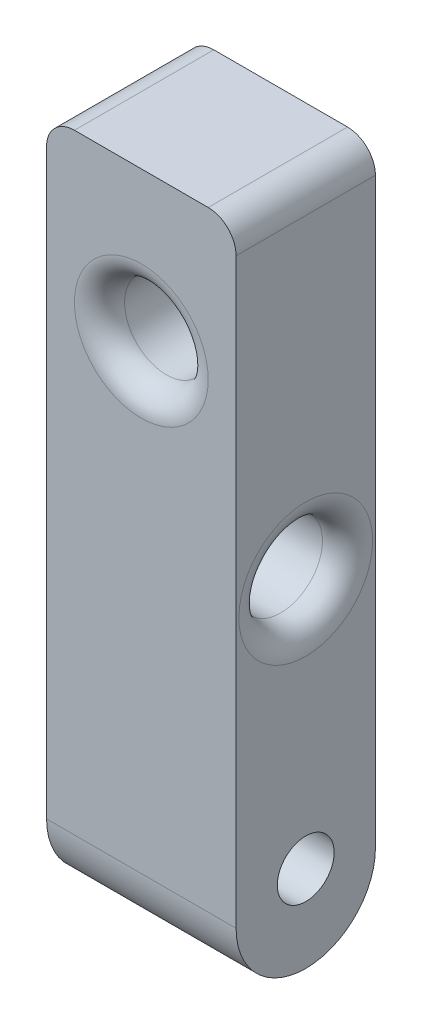
ISO-10303-21;
HEADER;
FILE_DESCRIPTION(('STEP AP214'),'2;1');
FILE_NAME('part.step','',(''),(''),'','','');
FILE_SCHEMA(('AUTOMOTIVE_DESIGN { 1 0 10303 214 1 1 1 1 }'));
ENDSEC;
DATA;
#1=APPLICATION_CONTEXT('core data for automotive mechanical design processes');
#2=APPLICATION_PROTOCOL_DEFINITION('international standard','automotive_design',2000,#1);
#3=PRODUCT_CONTEXT('',#1,'mechanical');
#4=PRODUCT('Part','Part','',(#3));
#5=PRODUCT_RELATED_PRODUCT_CATEGORY('part','',(#4));
#6=PRODUCT_DEFINITION_FORMATION('','',#4);
#7=PRODUCT_DEFINITION_CONTEXT('part definition',#1,'design');
#8=PRODUCT_DEFINITION('design','',#6,#7);
#9=PRODUCT_DEFINITION_SHAPE('','',#8);
#10=(LENGTH_UNIT() NAMED_UNIT(*) SI_UNIT(.MILLI.,.METRE.));
#11=(NAMED_UNIT(*) PLANE_ANGLE_UNIT() SI_UNIT($,.RADIAN.));
#12=(NAMED_UNIT(*) SI_UNIT($,.STERADIAN.) SOLID_ANGLE_UNIT());
#13=UNCERTAINTY_MEASURE_WITH_UNIT(LENGTH_MEASURE(1.E-05),#10,'distance_accuracy_value','');
#14=(GEOMETRIC_REPRESENTATION_CONTEXT(3) GLOBAL_UNCERTAINTY_ASSIGNED_CONTEXT((#13)) GLOBAL_UNIT_ASSIGNED_CONTEXT((#10,
#11,#12)) REPRESENTATION_CONTEXT('',''));
#15=CARTESIAN_POINT('',(0.,0.,0.));
#16=DIRECTION('',(0.,0.,1.));
#17=DIRECTION('',(1.,0.,0.));
#18=AXIS2_PLACEMENT_3D('',#15,#16,#17);
#19=CARTESIAN_POINT('',(-17.,-48.5,12.5));
#20=DIRECTION('',(1.,0.,0.));
#21=DIRECTION('',(0.,0.,-1.));
#22=AXIS2_PLACEMENT_3D('',#19,#20,#21);
#23=CYLINDRICAL_SURFACE('',#22,12.5);
#24=DIRECTION('',(-1.,0.,0.));
#25=VECTOR('',#24,1.);
#26=CARTESIAN_POINT('',(-17.,-48.5,25.));
#27=LINE('',#26,#25);
#28=CARTESIAN_POINT('',(-17.,-48.4999999999999,25.));
#29=VERTEX_POINT('',#28);
#30=CARTESIAN_POINT('',(17.,-48.5,25.));
#31=VERTEX_POINT('',#30);
#32=EDGE_CURVE('E155',#29,#31,#27,.F.);
#33=ORIENTED_EDGE('',*,*,#32,.F.);
#34=CARTESIAN_POINT('',(-17.,-48.5,12.5));
#35=DIRECTION('',(1.,0.,0.));
#36=DIRECTION('',(0.,1.,0.));
#37=AXIS2_PLACEMENT_3D('',#34,#35,#36);
#38=CIRCLE('',#37,12.5);
#39=CARTESIAN_POINT('',(-17.,-48.4999999999999,0.));
#40=VERTEX_POINT('',#39);
#41=EDGE_CURVE('E43',#40,#29,#38,.F.);
#42=ORIENTED_EDGE('',*,*,#41,.F.);
#43=DIRECTION('',(1.,0.,0.));
#44=VECTOR('',#43,1.);
#45=CARTESIAN_POINT('',(0.,-48.5,0.));
#46=LINE('',#45,#44);
#47=CARTESIAN_POINT('',(17.,-48.5,0.));
#48=VERTEX_POINT('',#47);
#49=EDGE_CURVE('E158',#48,#40,#46,.F.);
#50=ORIENTED_EDGE('',*,*,#49,.F.);
#51=CARTESIAN_POINT('',(17.,-48.5,12.5));
#52=DIRECTION('',(-1.,0.,0.));
#53=DIRECTION('',(0.,-1.,0.));
#54=AXIS2_PLACEMENT_3D('',#51,#52,#53);
#55=CIRCLE('',#54,12.5);
#56=EDGE_CURVE('E11',#31,#48,#55,.F.);
#57=ORIENTED_EDGE('',*,*,#56,.F.);
#58=EDGE_LOOP('',(#33,#42,#50,#57));
#59=FACE_BOUND('',#58,.T.);
#60=ADVANCED_FACE('F35',(#59),#23,.T.);
#61=CARTESIAN_POINT('',(-17.,-45.5,12.5));
#62=DIRECTION('',(1.,0.,0.));
#63=DIRECTION('',(0.,1.,0.));
#64=AXIS2_PLACEMENT_3D('',#61,#62,#63);
#65=CYLINDRICAL_SURFACE('',#64,5.1);
#66=CARTESIAN_POINT('',(17.,-45.5,12.5));
#67=DIRECTION('',(1.,0.,0.));
#68=DIRECTION('',(0.,1.,0.));
#69=AXIS2_PLACEMENT_3D('',#66,#67,#68);
#70=CIRCLE('',#69,5.1);
#71=CARTESIAN_POINT('',(17.,-40.4,12.5));
#72=VERTEX_POINT('',#71);
#73=EDGE_CURVE('E172',#72,#72,#70,.T.);
#74=ORIENTED_EDGE('',*,*,#73,.T.);
#75=EDGE_LOOP('',(#74));
#76=FACE_BOUND('',#75,.T.);
#77=CARTESIAN_POINT('',(-13.5,-45.5,12.5));
#78=DIRECTION('',(-1.,0.,0.));
#79=DIRECTION('',(0.,-1.,0.));
#80=AXIS2_PLACEMENT_3D('',#77,#78,#79);
#81=CIRCLE('',#80,5.1);
#82=CARTESIAN_POINT('',(-13.5,-50.6,12.5));
#83=VERTEX_POINT('',#82);
#84=EDGE_CURVE('E121',#83,#83,#81,.F.);
#85=ORIENTED_EDGE('',*,*,#84,.F.);
#86=EDGE_LOOP('',(#85));
#87=FACE_BOUND('',#86,.T.);
#88=ADVANCED_FACE('F235',(#76,#87),#65,.F.);
#89=CARTESIAN_POINT('',(0.,0.,25.));
#90=DIRECTION('',(0.,0.,1.));
#91=DIRECTION('',(1.,0.,0.));
#92=AXIS2_PLACEMENT_3D('',#89,#90,#91);
#93=PLANE('',#92);
#94=CARTESIAN_POINT('',(0.,34.25,25.));
#95=DIRECTION('',(0.,0.,1.));
#96=DIRECTION('',(1.,0.,0.));
#97=AXIS2_PLACEMENT_3D('',#94,#95,#96);
#98=CIRCLE('',#97,12.);
#99=CARTESIAN_POINT('',(12.,34.25,25.));
#100=VERTEX_POINT('',#99);
#101=EDGE_CURVE('E129',#100,#100,#98,.F.);
#102=ORIENTED_EDGE('',*,*,#101,.T.);
#103=EDGE_LOOP('',(#102));
#104=FACE_BOUND('',#103,.T.);
#105=DIRECTION('',(0.,-1.,0.));
#106=VECTOR('',#105,1.);
#107=CARTESIAN_POINT('',(-17.,61.,25.));
#108=LINE('',#107,#106);
#109=CARTESIAN_POINT('',(-17.,56.,25.));
#110=VERTEX_POINT('',#109);
#111=EDGE_CURVE('E130',#110,#29,#108,.T.);
#112=ORIENTED_EDGE('',*,*,#111,.T.);
#113=ORIENTED_EDGE('',*,*,#32,.T.);
#114=DIRECTION('',(0.,1.,0.));
#115=VECTOR('',#114,1.);
#116=CARTESIAN_POINT('',(17.,61.,25.));
#117=LINE('',#116,#115);
#118=CARTESIAN_POINT('',(17.,56.,25.));
#119=VERTEX_POINT('',#118);
#120=EDGE_CURVE('E115',#31,#119,#117,.T.);
#121=ORIENTED_EDGE('',*,*,#120,.T.);
#122=CARTESIAN_POINT('',(12.,56.,25.));
#123=DIRECTION('',(0.,0.,1.));
#124=DIRECTION('',(1.,0.,0.));
#125=AXIS2_PLACEMENT_3D('',#122,#123,#124);
#126=CIRCLE('',#125,5.);
#127=CARTESIAN_POINT('',(12.,61.,25.));
#128=VERTEX_POINT('',#127);
#129=EDGE_CURVE('E150',#119,#128,#126,.T.);
#130=ORIENTED_EDGE('',*,*,#129,.T.);
#131=DIRECTION('',(-1.,0.,0.));
#132=VECTOR('',#131,1.);
#133=CARTESIAN_POINT('',(-17.,61.,25.));
#134=LINE('',#133,#132);
#135=CARTESIAN_POINT('',(-12.,61.,25.));
#136=VERTEX_POINT('',#135);
#137=EDGE_CURVE('E105',#128,#136,#134,.T.);
#138=ORIENTED_EDGE('',*,*,#137,.T.);
#139=CARTESIAN_POINT('',(-12.,56.,25.));
#140=DIRECTION('',(0.,0.,1.));
#141=DIRECTION('',(1.,0.,0.));
#142=AXIS2_PLACEMENT_3D('',#139,#140,#141);
#143=CIRCLE('',#142,5.);
#144=EDGE_CURVE('E148',#136,#110,#143,.T.);
#145=ORIENTED_EDGE('',*,*,#144,.T.);
#146=EDGE_LOOP('',(#112,#113,#121,#130,#138,#145));
#147=FACE_BOUND('',#146,.T.);
#148=ADVANCED_FACE('F165',(#104,#147),#93,.T.);
#149=CARTESIAN_POINT('',(0.,0.,0.));
#150=DIRECTION('',(0.,0.,1.));
#151=DIRECTION('',(1.,0.,0.));
#152=AXIS2_PLACEMENT_3D('',#149,#150,#151);
#153=PLANE('',#152);
#154=CARTESIAN_POINT('',(0.,-23.,0.));
#155=DIRECTION('',(0.,0.,-1.));
#156=DIRECTION('',(-1.,0.,0.));
#157=AXIS2_PLACEMENT_3D('',#154,#155,#156);
#158=CIRCLE('',#157,4.1);
#159=CARTESIAN_POINT('',(-4.1,-23.,0.));
#160=VERTEX_POINT('',#159);
#161=EDGE_CURVE('E124',#160,#160,#158,.T.);
#162=ORIENTED_EDGE('',*,*,#161,.F.);
#163=EDGE_LOOP('',(#162));
#164=FACE_BOUND('',#163,.T.);
#165=DIRECTION('',(0.,1.,0.));
#166=VECTOR('',#165,1.);
#167=CARTESIAN_POINT('',(17.,61.,0.));
#168=LINE('',#167,#166);
#169=CARTESIAN_POINT('',(17.,56.,0.));
#170=VERTEX_POINT('',#169);
#171=EDGE_CURVE('E112',#48,#170,#168,.T.);
#172=ORIENTED_EDGE('',*,*,#171,.F.);
#173=ORIENTED_EDGE('',*,*,#49,.T.);
#174=DIRECTION('',(0.,-1.,0.));
#175=VECTOR('',#174,1.);
#176=CARTESIAN_POINT('',(-17.,61.,0.));
#177=LINE('',#176,#175);
#178=CARTESIAN_POINT('',(-17.,56.,0.));
#179=VERTEX_POINT('',#178);
#180=EDGE_CURVE('E111',#179,#40,#177,.T.);
#181=ORIENTED_EDGE('',*,*,#180,.F.);
#182=CARTESIAN_POINT('',(-12.,56.,0.));
#183=DIRECTION('',(0.,0.,1.));
#184=DIRECTION('',(1.,0.,0.));
#185=AXIS2_PLACEMENT_3D('',#182,#183,#184);
#186=CIRCLE('',#185,5.);
#187=CARTESIAN_POINT('',(-12.,61.,0.));
#188=VERTEX_POINT('',#187);
#189=EDGE_CURVE('E96',#179,#188,#186,.F.);
#190=ORIENTED_EDGE('',*,*,#189,.T.);
#191=DIRECTION('',(-1.,0.,0.));
#192=VECTOR('',#191,1.);
#193=CARTESIAN_POINT('',(-17.,61.,0.));
#194=LINE('',#193,#192);
#195=CARTESIAN_POINT('',(12.,61.,0.));
#196=VERTEX_POINT('',#195);
#197=EDGE_CURVE('E102',#196,#188,#194,.T.);
#198=ORIENTED_EDGE('',*,*,#197,.F.);
#199=CARTESIAN_POINT('',(12.,56.,0.));
#200=DIRECTION('',(0.,0.,1.));
#201=DIRECTION('',(1.,0.,0.));
#202=AXIS2_PLACEMENT_3D('',#199,#200,#201);
#203=CIRCLE('',#202,5.);
#204=EDGE_CURVE('E86',#196,#170,#203,.F.);
#205=ORIENTED_EDGE('',*,*,#204,.T.);
#206=EDGE_LOOP('',(#172,#173,#181,#190,#198,#205));
#207=FACE_BOUND('',#206,.T.);
#208=CARTESIAN_POINT('',(0.,34.25,0.));
#209=DIRECTION('',(0.,0.,1.));
#210=DIRECTION('',(1.,0.,0.));
#211=AXIS2_PLACEMENT_3D('',#208,#209,#210);
#212=CIRCLE('',#211,7.5);
#213=CARTESIAN_POINT('',(7.5,34.25,0.));
#214=VERTEX_POINT('',#213);
#215=EDGE_CURVE('E117',#214,#214,#212,.T.);
#216=ORIENTED_EDGE('',*,*,#215,.T.);
#217=EDGE_LOOP('',(#216));
#218=FACE_BOUND('',#217,.T.);
#219=ADVANCED_FACE('F108',(#164,#207,#218),#153,.F.);
#220=CARTESIAN_POINT('',(17.,61.,25.));
#221=DIRECTION('',(-1.,0.,0.));
#222=DIRECTION('',(0.,-1.,0.));
#223=AXIS2_PLACEMENT_3D('',#220,#221,#222);
#224=PLANE('',#223);
#225=CARTESIAN_POINT('',(17.,-0.499999999999973,12.5));
#226=DIRECTION('',(-1.,0.,0.));
#227=DIRECTION('',(0.,-1.,0.));
#228=AXIS2_PLACEMENT_3D('',#225,#226,#227);
#229=CIRCLE('',#228,12.);
#230=CARTESIAN_POINT('',(17.,-12.5,12.5));
#231=VERTEX_POINT('',#230);
#232=EDGE_CURVE('E139',#231,#231,#229,.T.);
#233=ORIENTED_EDGE('',*,*,#232,.T.);
#234=EDGE_LOOP('',(#233));
#235=FACE_BOUND('',#234,.T.);
#236=ORIENTED_EDGE('',*,*,#73,.F.);
#237=EDGE_LOOP('',(#236));
#238=FACE_BOUND('',#237,.T.);
#239=ORIENTED_EDGE('',*,*,#120,.F.);
#240=ORIENTED_EDGE('',*,*,#56,.T.);
#241=ORIENTED_EDGE('',*,*,#171,.T.);
#242=DIRECTION('',(0.,0.,-1.));
#243=VECTOR('',#242,1.);
#244=CARTESIAN_POINT('',(17.,56.,25.));
#245=LINE('',#244,#243);
#246=EDGE_CURVE('E92',#170,#119,#245,.F.);
#247=ORIENTED_EDGE('',*,*,#246,.T.);
#248=EDGE_LOOP('',(#239,#240,#241,#247));
#249=FACE_BOUND('',#248,.T.);
#250=ADVANCED_FACE('F255',(#235,#238,#249),#224,.F.);
#251=CARTESIAN_POINT('',(-17.,61.,25.));
#252=DIRECTION('',(0.,-1.,0.));
#253=DIRECTION('',(0.,0.,-1.));
#254=AXIS2_PLACEMENT_3D('',#251,#252,#253);
#255=PLANE('',#254);
#256=ORIENTED_EDGE('',*,*,#137,.F.);
#257=DIRECTION('',(0.,0.,-1.));
#258=VECTOR('',#257,1.);
#259=CARTESIAN_POINT('',(12.,61.,25.));
#260=LINE('',#259,#258);
#261=EDGE_CURVE('E90',#128,#196,#260,.T.);
#262=ORIENTED_EDGE('',*,*,#261,.T.);
#263=ORIENTED_EDGE('',*,*,#197,.T.);
#264=DIRECTION('',(0.,0.,-1.));
#265=VECTOR('',#264,1.);
#266=CARTESIAN_POINT('',(-12.,61.,25.));
#267=LINE('',#266,#265);
#268=EDGE_CURVE('E106',#188,#136,#267,.F.);
#269=ORIENTED_EDGE('',*,*,#268,.T.);
#270=EDGE_LOOP('',(#256,#262,#263,#269));
#271=FACE_BOUND('',#270,.T.);
#272=ADVANCED_FACE('F101',(#271),#255,.F.);
#273=CARTESIAN_POINT('',(-17.,61.,25.));
#274=DIRECTION('',(1.,0.,0.));
#275=DIRECTION('',(0.,1.,0.));
#276=AXIS2_PLACEMENT_3D('',#273,#274,#275);
#277=PLANE('',#276);
#278=CARTESIAN_POINT('',(-17.,-0.499999999999977,12.5));
#279=DIRECTION('',(1.,0.,0.));
#280=DIRECTION('',(0.,1.,0.));
#281=AXIS2_PLACEMENT_3D('',#278,#279,#280);
#282=CIRCLE('',#281,12.);
#283=CARTESIAN_POINT('',(-17.,11.5,12.5));
#284=VERTEX_POINT('',#283);
#285=EDGE_CURVE('E142',#284,#284,#282,.T.);
#286=ORIENTED_EDGE('',*,*,#285,.T.);
#287=EDGE_LOOP('',(#286));
#288=FACE_BOUND('',#287,.T.);
#289=CARTESIAN_POINT('',(-17.,-45.5,12.5));
#290=DIRECTION('',(-1.,0.,0.));
#291=DIRECTION('',(0.,-1.,0.));
#292=AXIS2_PLACEMENT_3D('',#289,#290,#291);
#293=CIRCLE('',#292,11.1);
#294=CARTESIAN_POINT('',(-17.,-56.6,12.5));
#295=VERTEX_POINT('',#294);
#296=EDGE_CURVE('E180',#295,#295,#293,.T.);
#297=ORIENTED_EDGE('',*,*,#296,.F.);
#298=EDGE_LOOP('',(#297));
#299=FACE_BOUND('',#298,.T.);
#300=ORIENTED_EDGE('',*,*,#180,.T.);
#301=ORIENTED_EDGE('',*,*,#41,.T.);
#302=ORIENTED_EDGE('',*,*,#111,.F.);
#303=DIRECTION('',(0.,0.,-1.));
#304=VECTOR('',#303,1.);
#305=CARTESIAN_POINT('',(-17.,56.,25.));
#306=LINE('',#305,#304);
#307=EDGE_CURVE('E152',#110,#179,#306,.T.);
#308=ORIENTED_EDGE('',*,*,#307,.T.);
#309=EDGE_LOOP('',(#300,#301,#302,#308));
#310=FACE_BOUND('',#309,.T.);
#311=ADVANCED_FACE('F161',(#288,#299,#310),#277,.F.);
#312=CARTESIAN_POINT('',(0.,34.25,25.));
#313=DIRECTION('',(0.,0.,-1.));
#314=DIRECTION('',(-1.,0.,0.));
#315=AXIS2_PLACEMENT_3D('',#312,#313,#314);
#316=CYLINDRICAL_SURFACE('',#315,7.5);
#317=CARTESIAN_POINT('',(0.,34.25,20.5));
#318=DIRECTION('',(0.,0.,1.));
#319=DIRECTION('',(1.,0.,0.));
#320=AXIS2_PLACEMENT_3D('',#317,#318,#319);
#321=CIRCLE('',#320,7.5);
#322=CARTESIAN_POINT('',(7.5,34.25,20.5));
#323=VERTEX_POINT('',#322);
#324=EDGE_CURVE('E126',#323,#323,#321,.T.);
#325=ORIENTED_EDGE('',*,*,#324,.T.);
#326=EDGE_LOOP('',(#325));
#327=FACE_BOUND('',#326,.T.);
#328=ORIENTED_EDGE('',*,*,#215,.F.);
#329=EDGE_LOOP('',(#328));
#330=FACE_BOUND('',#329,.T.);
#331=ADVANCED_FACE('F249',(#327,#330),#316,.F.);
#332=CARTESIAN_POINT('',(-17.,-0.499999999999977,12.5));
#333=DIRECTION('',(1.,0.,0.));
#334=DIRECTION('',(0.,1.,0.));
#335=AXIS2_PLACEMENT_3D('',#332,#333,#334);
#336=CYLINDRICAL_SURFACE('',#335,7.5);
#337=CARTESIAN_POINT('',(12.5,-0.499999999999973,12.5));
#338=DIRECTION('',(-1.,0.,0.));
#339=DIRECTION('',(0.,-1.,0.));
#340=AXIS2_PLACEMENT_3D('',#337,#338,#339);
#341=CIRCLE('',#340,7.5);
#342=CARTESIAN_POINT('',(12.5,7.00000000000003,12.5));
#343=VERTEX_POINT('',#342);
#344=EDGE_CURVE('E136',#343,#343,#341,.F.);
#345=CARTESIAN_POINT('',(-12.5,-0.499999999999977,12.5));
#346=DIRECTION('',(1.,0.,0.));
#347=DIRECTION('',(0.,1.,0.));
#348=AXIS2_PLACEMENT_3D('',#345,#346,#347);
#349=CIRCLE('',#348,7.5);
#350=CARTESIAN_POINT('',(-12.5,7.00000000000002,12.5));
#351=VERTEX_POINT('',#350);
#352=EDGE_CURVE('E133',#351,#351,#349,.F.);
#353=CARTESIAN_POINT('',(12.5,7.00000000000003,12.5));
#354=CARTESIAN_POINT('',(12.2395833333333,7.00000000000003,12.5));
#355=CARTESIAN_POINT('',(11.9791666666667,7.00000000000003,12.5));
#356=CARTESIAN_POINT('',(11.4583333333333,7.00000000000003,12.5));
#357=CARTESIAN_POINT('',(11.1979166666667,7.00000000000003,12.5));
#358=CARTESIAN_POINT('',(10.6770833333333,7.00000000000003,12.5));
#359=CARTESIAN_POINT('',(10.4166666666667,7.00000000000003,12.5));
#360=CARTESIAN_POINT('',(9.89583333333333,7.00000000000003,12.5));
#361=CARTESIAN_POINT('',(9.63541666666667,7.00000000000003,12.5));
#362=CARTESIAN_POINT('',(9.11458333333334,7.00000000000003,12.5));
#363=CARTESIAN_POINT('',(8.85416666666667,7.00000000000003,12.5));
#364=CARTESIAN_POINT('',(8.33333333333334,7.00000000000003,12.5));
#365=CARTESIAN_POINT('',(8.07291666666667,7.00000000000003,12.5));
#366=CARTESIAN_POINT('',(7.55208333333334,7.00000000000003,12.5));
#367=CARTESIAN_POINT('',(7.29166666666667,7.00000000000003,12.5));
#368=CARTESIAN_POINT('',(6.77083333333334,7.00000000000003,12.5));
#369=CARTESIAN_POINT('',(6.51041666666667,7.00000000000003,12.5));
#370=CARTESIAN_POINT('',(5.98958333333334,7.00000000000003,12.5));
#371=CARTESIAN_POINT('',(5.72916666666667,7.00000000000003,12.5));
#372=CARTESIAN_POINT('',(5.20833333333333,7.00000000000003,12.5));
#373=CARTESIAN_POINT('',(4.94791666666667,7.00000000000002,12.5));
#374=CARTESIAN_POINT('',(4.42708333333333,7.00000000000002,12.5));
#375=CARTESIAN_POINT('',(4.16666666666667,7.00000000000002,12.5));
#376=CARTESIAN_POINT('',(3.64583333333333,7.00000000000002,12.5));
#377=CARTESIAN_POINT('',(3.38541666666667,7.00000000000002,12.5));
#378=CARTESIAN_POINT('',(2.86458333333333,7.00000000000002,12.5));
#379=CARTESIAN_POINT('',(2.60416666666667,7.00000000000002,12.5));
#380=CARTESIAN_POINT('',(2.08333333333333,7.00000000000002,12.5));
#381=CARTESIAN_POINT('',(1.82291666666667,7.00000000000002,12.5));
#382=CARTESIAN_POINT('',(1.30208333333333,7.00000000000002,12.5));
#383=CARTESIAN_POINT('',(1.04166666666667,7.00000000000002,12.5));
#384=CARTESIAN_POINT('',(0.520833333333334,7.00000000000002,12.5));
#385=CARTESIAN_POINT('',(0.260416666666667,7.00000000000002,12.5));
#386=CARTESIAN_POINT('',(-0.260416666666667,7.00000000000002,12.5));
#387=CARTESIAN_POINT('',(-0.520833333333334,7.00000000000002,12.5));
#388=CARTESIAN_POINT('',(-1.04166666666667,7.00000000000002,12.5));
#389=CARTESIAN_POINT('',(-1.30208333333333,7.00000000000002,12.5));
#390=CARTESIAN_POINT('',(-1.82291666666667,7.00000000000002,12.5));
#391=CARTESIAN_POINT('',(-2.08333333333333,7.00000000000002,12.5));
#392=CARTESIAN_POINT('',(-2.60416666666667,7.00000000000002,12.5));
#393=CARTESIAN_POINT('',(-2.86458333333334,7.00000000000002,12.5));
#394=CARTESIAN_POINT('',(-3.38541666666667,7.00000000000002,12.5));
#395=CARTESIAN_POINT('',(-3.64583333333333,7.00000000000002,12.5));
#396=CARTESIAN_POINT('',(-4.16666666666667,7.00000000000002,12.5));
#397=CARTESIAN_POINT('',(-4.42708333333333,7.00000000000002,12.5));
#398=CARTESIAN_POINT('',(-4.94791666666667,7.00000000000002,12.5));
#399=CARTESIAN_POINT('',(-5.20833333333333,7.00000000000002,12.5));
#400=CARTESIAN_POINT('',(-5.72916666666667,7.00000000000002,12.5));
#401=CARTESIAN_POINT('',(-5.98958333333334,7.00000000000002,12.5));
#402=CARTESIAN_POINT('',(-6.51041666666667,7.00000000000002,12.5));
#403=CARTESIAN_POINT('',(-6.77083333333334,7.00000000000002,12.5));
#404=CARTESIAN_POINT('',(-7.29166666666667,7.00000000000002,12.5));
#405=CARTESIAN_POINT('',(-7.55208333333334,7.00000000000002,12.5));
#406=CARTESIAN_POINT('',(-8.07291666666667,7.00000000000002,12.5));
#407=CARTESIAN_POINT('',(-8.33333333333334,7.00000000000002,12.5));
#408=CARTESIAN_POINT('',(-8.85416666666667,7.00000000000002,12.5));
#409=CARTESIAN_POINT('',(-9.11458333333334,7.00000000000002,12.5));
#410=CARTESIAN_POINT('',(-9.63541666666667,7.00000000000002,12.5));
#411=CARTESIAN_POINT('',(-9.89583333333333,7.00000000000002,12.5));
#412=CARTESIAN_POINT('',(-10.4166666666667,7.00000000000002,12.5));
#413=CARTESIAN_POINT('',(-10.6770833333333,7.00000000000002,12.5));
#414=CARTESIAN_POINT('',(-11.1979166666667,7.00000000000002,12.5));
#415=CARTESIAN_POINT('',(-11.4583333333333,7.00000000000002,12.5));
#416=CARTESIAN_POINT('',(-11.9791666666667,7.00000000000002,12.5));
#417=CARTESIAN_POINT('',(-12.2395833333333,7.00000000000002,12.5));
#418=CARTESIAN_POINT('',(-12.5,7.00000000000002,12.5));
#419=B_SPLINE_CURVE_WITH_KNOTS('',3,(#353,#354,#355,#356,#357,#358,#359,#360,#361,#362,#363,
#364,#365,#366,#367,#368,#369,#370,#371,#372,#373,#374,#375,#376,#377,#378,#379,#380,#381,#382,
#383,#384,#385,#386,#387,#388,#389,#390,#391,#392,#393,#394,#395,#396,#397,#398,#399,#400,#401,
#402,#403,#404,#405,#406,#407,#408,#409,#410,#411,#412,#413,#414,#415,#416,#417,#418),
.UNSPECIFIED.,.F.,.F.,(4,2,2,2,2,2,2,2,2,2,2,2,2,2,2,2,2,2,2,2,2,2,2,2,2,2,2,2,2,2,2,2,4),(0.,
0.781250000000001,1.5625,2.34375,3.125,3.90625,4.6875,5.46875,6.25,7.03125,7.8125,8.59375,9.375,
10.15625,10.9375,11.71875,12.5,13.28125,14.0625,14.84375,15.625,16.40625,17.1875,17.96875,18.75,
19.53125,20.3125,21.09375,21.875,22.65625,23.4375,24.21875,25.),.UNSPECIFIED.);
#420=EDGE_CURVE('BSEAM247',#343,#351,#419,.T.);
#421=ORIENTED_EDGE('',*,*,#344,.T.);
#422=ORIENTED_EDGE('',*,*,#352,.T.);
#423=ORIENTED_EDGE('',*,*,#420,.T.);
#424=ORIENTED_EDGE('',*,*,#420,.F.);
#425=EDGE_LOOP('',(#421,#423,#422,#424));
#426=FACE_BOUND('',#425,.T.);
#427=ADVANCED_FACE('F247',(#426),#336,.F.);
#428=CARTESIAN_POINT('',(0.,-23.,18.));
#429=DIRECTION('',(0.,0.,-1.));
#430=DIRECTION('',(-1.,0.,0.));
#431=AXIS2_PLACEMENT_3D('',#428,#429,#430);
#432=CYLINDRICAL_SURFACE('',#431,4.1);
#433=CARTESIAN_POINT('',(0.,-23.,18.));
#434=DIRECTION('',(0.,0.,-1.));
#435=DIRECTION('',(-1.,0.,0.));
#436=AXIS2_PLACEMENT_3D('',#433,#434,#435);
#437=CIRCLE('',#436,4.1);
#438=CARTESIAN_POINT('',(-4.1,-23.,18.));
#439=VERTEX_POINT('',#438);
#440=EDGE_CURVE('E175',#439,#439,#437,.T.);
#441=ORIENTED_EDGE('',*,*,#440,.F.);
#442=EDGE_LOOP('',(#441));
#443=FACE_BOUND('',#442,.T.);
#444=ORIENTED_EDGE('',*,*,#161,.T.);
#445=EDGE_LOOP('',(#444));
#446=FACE_BOUND('',#445,.T.);
#447=ADVANCED_FACE('F377',(#443,#446),#432,.F.);
#448=CARTESIAN_POINT('',(0.,-23.,18.));
#449=DIRECTION('',(0.,0.,-1.));
#450=DIRECTION('',(-1.,0.,0.));
#451=AXIS2_PLACEMENT_3D('',#448,#449,#450);
#452=PLANE('',#451);
#453=ORIENTED_EDGE('',*,*,#440,.T.);
#454=EDGE_LOOP('',(#453));
#455=FACE_BOUND('',#454,.T.);
#456=ADVANCED_FACE('F223',(#455),#452,.T.);
#457=CARTESIAN_POINT('',(-13.5,-45.5,12.5));
#458=DIRECTION('',(-1.,0.,0.));
#459=DIRECTION('',(0.,-1.,0.));
#460=AXIS2_PLACEMENT_3D('',#457,#458,#459);
#461=PLANE('',#460);
#462=CARTESIAN_POINT('',(-13.5,-37.5,12.5));
#463=DIRECTION('',(-1.,0.,0.));
#464=DIRECTION('',(0.,-1.,0.));
#465=AXIS2_PLACEMENT_3D('',#462,#463,#464);
#466=CIRCLE('',#465,1.4);
#467=CARTESIAN_POINT('',(-13.5,-38.9,12.5));
#468=VERTEX_POINT('',#467);
#469=EDGE_CURVE('E204',#468,#468,#466,.T.);
#470=ORIENTED_EDGE('',*,*,#469,.F.);
#471=EDGE_LOOP('',(#470));
#472=FACE_BOUND('',#471,.T.);
#473=CARTESIAN_POINT('',(-13.5,-45.4999999999998,20.5000000000002));
#474=DIRECTION('',(-1.,0.,0.));
#475=DIRECTION('',(0.,-1.,0.));
#476=AXIS2_PLACEMENT_3D('',#473,#474,#475);
#477=CIRCLE('',#476,1.4);
#478=CARTESIAN_POINT('',(-13.5,-46.8999999999998,20.5000000000002));
#479=VERTEX_POINT('',#478);
#480=EDGE_CURVE('E198',#479,#479,#477,.T.);
#481=ORIENTED_EDGE('',*,*,#480,.F.);
#482=EDGE_LOOP('',(#481));
#483=FACE_BOUND('',#482,.T.);
#484=CARTESIAN_POINT('',(-13.5,-53.5,12.5000000000004));
#485=DIRECTION('',(-1.,0.,0.));
#486=DIRECTION('',(0.,-1.,0.));
#487=AXIS2_PLACEMENT_3D('',#484,#485,#486);
#488=CIRCLE('',#487,1.4);
#489=CARTESIAN_POINT('',(-13.5,-54.9,12.5000000000004));
#490=VERTEX_POINT('',#489);
#491=EDGE_CURVE('E192',#490,#490,#488,.T.);
#492=ORIENTED_EDGE('',*,*,#491,.F.);
#493=EDGE_LOOP('',(#492));
#494=FACE_BOUND('',#493,.T.);
#495=CARTESIAN_POINT('',(-13.5,-45.5000000000001,4.50000000000023));
#496=DIRECTION('',(-1.,0.,0.));
#497=DIRECTION('',(0.,-1.,0.));
#498=AXIS2_PLACEMENT_3D('',#495,#496,#497);
#499=CIRCLE('',#498,1.4);
#500=CARTESIAN_POINT('',(-13.5,-46.9000000000001,4.50000000000023));
#501=VERTEX_POINT('',#500);
#502=EDGE_CURVE('E186',#501,#501,#499,.T.);
#503=ORIENTED_EDGE('',*,*,#502,.F.);
#504=EDGE_LOOP('',(#503));
#505=FACE_BOUND('',#504,.T.);
#506=CARTESIAN_POINT('',(-13.5,-45.5,12.5));
#507=DIRECTION('',(-1.,0.,0.));
#508=DIRECTION('',(0.,-1.,0.));
#509=AXIS2_PLACEMENT_3D('',#506,#507,#508);
#510=CIRCLE('',#509,11.1);
#511=CARTESIAN_POINT('',(-13.5,-56.6,12.5));
#512=VERTEX_POINT('',#511);
#513=EDGE_CURVE('E125',#512,#512,#510,.T.);
#514=ORIENTED_EDGE('',*,*,#513,.T.);
#515=EDGE_LOOP('',(#514));
#516=FACE_BOUND('',#515,.T.);
#517=ORIENTED_EDGE('',*,*,#84,.T.);
#518=EDGE_LOOP('',(#517));
#519=FACE_BOUND('',#518,.T.);
#520=ADVANCED_FACE('F219',(#472,#483,#494,#505,#516,#519),#461,.T.);
#521=CARTESIAN_POINT('',(-13.5,-45.5,12.5));
#522=DIRECTION('',(-1.,0.,0.));
#523=DIRECTION('',(0.,-1.,0.));
#524=AXIS2_PLACEMENT_3D('',#521,#522,#523);
#525=CYLINDRICAL_SURFACE('',#524,11.1);
#526=ORIENTED_EDGE('',*,*,#513,.F.);
#527=EDGE_LOOP('',(#526));
#528=FACE_BOUND('',#527,.T.);
#529=ORIENTED_EDGE('',*,*,#296,.T.);
#530=EDGE_LOOP('',(#529));
#531=FACE_BOUND('',#530,.T.);
#532=ADVANCED_FACE('F222',(#528,#531),#525,.F.);
#533=CARTESIAN_POINT('',(-3.5,-45.5000000000001,4.50000000000023));
#534=DIRECTION('',(-1.,0.,0.));
#535=DIRECTION('',(0.,-1.,0.));
#536=AXIS2_PLACEMENT_3D('',#533,#534,#535);
#537=CYLINDRICAL_SURFACE('',#536,1.4);
#538=CARTESIAN_POINT('',(-3.5,-45.5000000000001,4.50000000000023));
#539=DIRECTION('',(-1.,0.,0.));
#540=DIRECTION('',(0.,-1.,0.));
#541=AXIS2_PLACEMENT_3D('',#538,#539,#540);
#542=CIRCLE('',#541,1.4);
#543=CARTESIAN_POINT('',(-3.5,-46.9000000000001,4.50000000000023));
#544=VERTEX_POINT('',#543);
#545=EDGE_CURVE('E189',#544,#544,#542,.T.);
#546=ORIENTED_EDGE('',*,*,#545,.F.);
#547=EDGE_LOOP('',(#546));
#548=FACE_BOUND('',#547,.T.);
#549=ORIENTED_EDGE('',*,*,#502,.T.);
#550=EDGE_LOOP('',(#549));
#551=FACE_BOUND('',#550,.T.);
#552=ADVANCED_FACE('F351',(#548,#551),#537,.F.);
#553=CARTESIAN_POINT('',(-3.5,-45.5000000000001,4.50000000000023));
#554=DIRECTION('',(-1.,0.,0.));
#555=DIRECTION('',(0.,-1.,0.));
#556=AXIS2_PLACEMENT_3D('',#553,#554,#555);
#557=PLANE('',#556);
#558=ORIENTED_EDGE('',*,*,#545,.T.);
#559=EDGE_LOOP('',(#558));
#560=FACE_BOUND('',#559,.T.);
#561=ADVANCED_FACE('F343',(#560),#557,.T.);
#562=CARTESIAN_POINT('',(-3.5,-53.5,12.5000000000004));
#563=DIRECTION('',(-1.,0.,0.));
#564=DIRECTION('',(0.,-1.,0.));
#565=AXIS2_PLACEMENT_3D('',#562,#563,#564);
#566=CYLINDRICAL_SURFACE('',#565,1.4);
#567=CARTESIAN_POINT('',(-3.5,-53.5,12.5000000000004));
#568=DIRECTION('',(-1.,0.,0.));
#569=DIRECTION('',(0.,-1.,0.));
#570=AXIS2_PLACEMENT_3D('',#567,#568,#569);
#571=CIRCLE('',#570,1.4);
#572=CARTESIAN_POINT('',(-3.5,-54.9,12.5000000000004));
#573=VERTEX_POINT('',#572);
#574=EDGE_CURVE('E195',#573,#573,#571,.T.);
#575=ORIENTED_EDGE('',*,*,#574,.F.);
#576=EDGE_LOOP('',(#575));
#577=FACE_BOUND('',#576,.T.);
#578=ORIENTED_EDGE('',*,*,#491,.T.);
#579=EDGE_LOOP('',(#578));
#580=FACE_BOUND('',#579,.T.);
#581=ADVANCED_FACE('F335',(#577,#580),#566,.F.);
#582=CARTESIAN_POINT('',(-3.5,-53.5,12.5000000000004));
#583=DIRECTION('',(-1.,0.,0.));
#584=DIRECTION('',(0.,-1.,0.));
#585=AXIS2_PLACEMENT_3D('',#582,#583,#584);
#586=PLANE('',#585);
#587=ORIENTED_EDGE('',*,*,#574,.T.);
#588=EDGE_LOOP('',(#587));
#589=FACE_BOUND('',#588,.T.);
#590=ADVANCED_FACE('F327',(#589),#586,.T.);
#591=CARTESIAN_POINT('',(-3.5,-45.4999999999998,20.5000000000002));
#592=DIRECTION('',(-1.,0.,0.));
#593=DIRECTION('',(0.,-1.,0.));
#594=AXIS2_PLACEMENT_3D('',#591,#592,#593);
#595=CYLINDRICAL_SURFACE('',#594,1.4);
#596=CARTESIAN_POINT('',(-3.5,-45.4999999999998,20.5000000000002));
#597=DIRECTION('',(-1.,0.,0.));
#598=DIRECTION('',(0.,-1.,0.));
#599=AXIS2_PLACEMENT_3D('',#596,#597,#598);
#600=CIRCLE('',#599,1.4);
#601=CARTESIAN_POINT('',(-3.5,-46.8999999999998,20.5000000000002));
#602=VERTEX_POINT('',#601);
#603=EDGE_CURVE('E201',#602,#602,#600,.T.);
#604=ORIENTED_EDGE('',*,*,#603,.F.);
#605=EDGE_LOOP('',(#604));
#606=FACE_BOUND('',#605,.T.);
#607=ORIENTED_EDGE('',*,*,#480,.T.);
#608=EDGE_LOOP('',(#607));
#609=FACE_BOUND('',#608,.T.);
#610=ADVANCED_FACE('F319',(#606,#609),#595,.F.);
#611=CARTESIAN_POINT('',(-3.5,-45.4999999999998,20.5000000000002));
#612=DIRECTION('',(-1.,0.,0.));
#613=DIRECTION('',(0.,-1.,0.));
#614=AXIS2_PLACEMENT_3D('',#611,#612,#613);
#615=PLANE('',#614);
#616=ORIENTED_EDGE('',*,*,#603,.T.);
#617=EDGE_LOOP('',(#616));
#618=FACE_BOUND('',#617,.T.);
#619=ADVANCED_FACE('F215',(#618),#615,.T.);
#620=CARTESIAN_POINT('',(-3.5,-37.5,12.5));
#621=DIRECTION('',(-1.,0.,0.));
#622=DIRECTION('',(0.,-1.,0.));
#623=AXIS2_PLACEMENT_3D('',#620,#621,#622);
#624=CYLINDRICAL_SURFACE('',#623,1.4);
#625=CARTESIAN_POINT('',(-3.5,-37.5,12.5));
#626=DIRECTION('',(-1.,0.,0.));
#627=DIRECTION('',(0.,-1.,0.));
#628=AXIS2_PLACEMENT_3D('',#625,#626,#627);
#629=CIRCLE('',#628,1.4);
#630=CARTESIAN_POINT('',(-3.5,-38.9,12.5));
#631=VERTEX_POINT('',#630);
#632=EDGE_CURVE('E183',#631,#631,#629,.T.);
#633=ORIENTED_EDGE('',*,*,#632,.F.);
#634=EDGE_LOOP('',(#633));
#635=FACE_BOUND('',#634,.T.);
#636=ORIENTED_EDGE('',*,*,#469,.T.);
#637=EDGE_LOOP('',(#636));
#638=FACE_BOUND('',#637,.T.);
#639=ADVANCED_FACE('F212',(#635,#638),#624,.F.);
#640=CARTESIAN_POINT('',(-3.5,-37.5,12.5));
#641=DIRECTION('',(-1.,0.,0.));
#642=DIRECTION('',(0.,-1.,0.));
#643=AXIS2_PLACEMENT_3D('',#640,#641,#642);
#644=PLANE('',#643);
#645=ORIENTED_EDGE('',*,*,#632,.T.);
#646=EDGE_LOOP('',(#645));
#647=FACE_BOUND('',#646,.T.);
#648=ADVANCED_FACE('F210',(#647),#644,.T.);
#649=CARTESIAN_POINT('',(0.,34.25,20.5));
#650=DIRECTION('',(0.,0.,1.));
#651=DIRECTION('',(1.,0.,0.));
#652=AXIS2_PLACEMENT_3D('',#649,#650,#651);
#653=TOROIDAL_SURFACE('',#652,12.,4.5);
#654=ORIENTED_EDGE('',*,*,#101,.F.);
#655=EDGE_LOOP('',(#654));
#656=FACE_BOUND('',#655,.T.);
#657=ORIENTED_EDGE('',*,*,#324,.F.);
#658=EDGE_LOOP('',(#657));
#659=FACE_BOUND('',#658,.T.);
#660=ADVANCED_FACE('F265',(#656,#659),#653,.T.);
#661=CARTESIAN_POINT('',(12.5,-0.499999999999973,12.5));
#662=DIRECTION('',(-1.,0.,0.));
#663=DIRECTION('',(0.,-1.,0.));
#664=AXIS2_PLACEMENT_3D('',#661,#662,#663);
#665=TOROIDAL_SURFACE('',#664,12.,4.5);
#666=ORIENTED_EDGE('',*,*,#232,.F.);
#667=EDGE_LOOP('',(#666));
#668=FACE_BOUND('',#667,.T.);
#669=ORIENTED_EDGE('',*,*,#344,.F.);
#670=EDGE_LOOP('',(#669));
#671=FACE_BOUND('',#670,.T.);
#672=ADVANCED_FACE('F268',(#668,#671),#665,.T.);
#673=CARTESIAN_POINT('',(-12.5,-0.499999999999977,12.5));
#674=DIRECTION('',(1.,0.,0.));
#675=DIRECTION('',(0.,1.,0.));
#676=AXIS2_PLACEMENT_3D('',#673,#674,#675);
#677=TOROIDAL_SURFACE('',#676,12.,4.5);
#678=ORIENTED_EDGE('',*,*,#352,.F.);
#679=EDGE_LOOP('',(#678));
#680=FACE_BOUND('',#679,.T.);
#681=ORIENTED_EDGE('',*,*,#285,.F.);
#682=EDGE_LOOP('',(#681));
#683=FACE_BOUND('',#682,.T.);
#684=ADVANCED_FACE('F272',(#680,#683),#677,.T.);
#685=CARTESIAN_POINT('',(12.,56.,25.));
#686=DIRECTION('',(0.,0.,-1.));
#687=DIRECTION('',(-1.,0.,0.));
#688=AXIS2_PLACEMENT_3D('',#685,#686,#687);
#689=CYLINDRICAL_SURFACE('',#688,5.);
#690=ORIENTED_EDGE('',*,*,#129,.F.);
#691=ORIENTED_EDGE('',*,*,#246,.F.);
#692=ORIENTED_EDGE('',*,*,#204,.F.);
#693=ORIENTED_EDGE('',*,*,#261,.F.);
#694=EDGE_LOOP('',(#690,#691,#692,#693));
#695=FACE_BOUND('',#694,.T.);
#696=ADVANCED_FACE('F89',(#695),#689,.T.);
#697=CARTESIAN_POINT('',(-12.,56.,25.));
#698=DIRECTION('',(0.,0.,-1.));
#699=DIRECTION('',(-1.,0.,0.));
#700=AXIS2_PLACEMENT_3D('',#697,#698,#699);
#701=CYLINDRICAL_SURFACE('',#700,5.);
#702=ORIENTED_EDGE('',*,*,#144,.F.);
#703=ORIENTED_EDGE('',*,*,#268,.F.);
#704=ORIENTED_EDGE('',*,*,#189,.F.);
#705=ORIENTED_EDGE('',*,*,#307,.F.);
#706=EDGE_LOOP('',(#702,#703,#704,#705));
#707=FACE_BOUND('',#706,.T.);
#708=ADVANCED_FACE('F278',(#707),#701,.T.);
#709=CLOSED_SHELL('',(#60,#88,#148,#219,#250,#272,#311,#331,#427,#447,#456,#520,#532,#552,#561,
#581,#590,#610,#619,#639,#648,#660,#672,#684,#696,#708));
#710=MANIFOLD_SOLID_BREP('B2',#709);
#711=ADVANCED_BREP_SHAPE_REPRESENTATION('',(#18,#710),#14);
#712=SHAPE_DEFINITION_REPRESENTATION(#9,#711);
ENDSEC;
END-ISO-10303-21;
